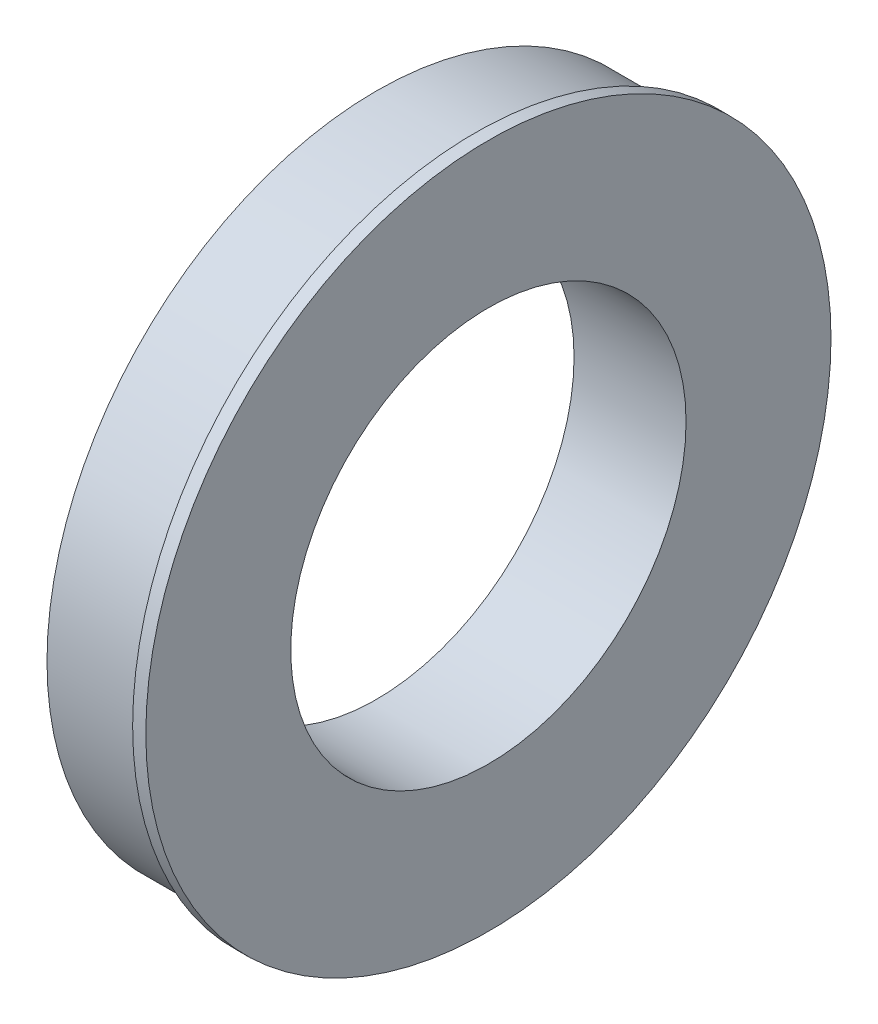
ISO-10303-21;
HEADER;
FILE_DESCRIPTION(('STEP AP214'),'2;1');
FILE_NAME('part.step','',(''),(''),'','','');
FILE_SCHEMA(('AUTOMOTIVE_DESIGN { 1 0 10303 214 1 1 1 1 }'));
ENDSEC;
DATA;
#1=APPLICATION_CONTEXT('core data for automotive mechanical design processes');
#2=APPLICATION_PROTOCOL_DEFINITION('international standard','automotive_design',2000,#1);
#3=PRODUCT_CONTEXT('',#1,'mechanical');
#4=PRODUCT('Part','Part','',(#3));
#5=PRODUCT_RELATED_PRODUCT_CATEGORY('part','',(#4));
#6=PRODUCT_DEFINITION_FORMATION('','',#4);
#7=PRODUCT_DEFINITION_CONTEXT('part definition',#1,'design');
#8=PRODUCT_DEFINITION('design','',#6,#7);
#9=PRODUCT_DEFINITION_SHAPE('','',#8);
#10=(LENGTH_UNIT() NAMED_UNIT(*) SI_UNIT(.MILLI.,.METRE.));
#11=(NAMED_UNIT(*) PLANE_ANGLE_UNIT() SI_UNIT($,.RADIAN.));
#12=(NAMED_UNIT(*) SI_UNIT($,.STERADIAN.) SOLID_ANGLE_UNIT());
#13=UNCERTAINTY_MEASURE_WITH_UNIT(LENGTH_MEASURE(1.E-05),#10,'distance_accuracy_value','');
#14=(GEOMETRIC_REPRESENTATION_CONTEXT(3) GLOBAL_UNCERTAINTY_ASSIGNED_CONTEXT((#13)) GLOBAL_UNIT_ASSIGNED_CONTEXT((#10,
#11,#12)) REPRESENTATION_CONTEXT('',''));
#15=CARTESIAN_POINT('',(0.,0.,0.));
#16=DIRECTION('',(0.,0.,1.));
#17=DIRECTION('',(1.,0.,0.));
#18=AXIS2_PLACEMENT_3D('',#15,#16,#17);
#19=CARTESIAN_POINT('',(0.,0.,0.));
#20=DIRECTION('',(1.,0.,0.));
#21=DIRECTION('',(0.,0.,-1.));
#22=AXIS2_PLACEMENT_3D('',#19,#20,#21);
#23=PLANE('',#22);
#24=CARTESIAN_POINT('',(0.,0.,0.));
#25=DIRECTION('',(1.,0.,0.));
#26=DIRECTION('',(0.,0.,-1.));
#27=AXIS2_PLACEMENT_3D('',#24,#25,#26);
#28=CIRCLE('',#27,63.5);
#29=CARTESIAN_POINT('',(0.,0.,-63.5));
#30=VERTEX_POINT('',#29);
#31=EDGE_CURVE('E41',#30,#30,#28,.T.);
#32=ORIENTED_EDGE('',*,*,#31,.F.);
#33=EDGE_LOOP('',(#32));
#34=FACE_BOUND('',#33,.T.);
#35=CARTESIAN_POINT('',(0.,0.,0.));
#36=DIRECTION('',(1.,0.,0.));
#37=DIRECTION('',(0.,0.,-1.));
#38=AXIS2_PLACEMENT_3D('',#35,#36,#37);
#39=CIRCLE('',#38,38.1);
#40=CARTESIAN_POINT('',(0.,0.,-38.1));
#41=VERTEX_POINT('',#40);
#42=EDGE_CURVE('E50',#41,#41,#39,.T.);
#43=ORIENTED_EDGE('',*,*,#42,.T.);
#44=EDGE_LOOP('',(#43));
#45=FACE_BOUND('',#44,.T.);
#46=ADVANCED_FACE('F37',(#34,#45),#23,.F.);
#47=CARTESIAN_POINT('',(19.05,0.,0.));
#48=DIRECTION('',(-1.,0.,0.));
#49=DIRECTION('',(0.,0.,1.));
#50=AXIS2_PLACEMENT_3D('',#47,#48,#49);
#51=CYLINDRICAL_SURFACE('',#50,63.5);
#52=CARTESIAN_POINT('',(19.05,0.,0.));
#53=DIRECTION('',(1.,0.,0.));
#54=DIRECTION('',(0.,0.,-1.));
#55=AXIS2_PLACEMENT_3D('',#52,#53,#54);
#56=CIRCLE('',#55,63.5);
#57=CARTESIAN_POINT('',(19.05,0.,-63.5));
#58=VERTEX_POINT('',#57);
#59=EDGE_CURVE('E10',#58,#58,#56,.T.);
#60=ORIENTED_EDGE('',*,*,#59,.F.);
#61=EDGE_LOOP('',(#60));
#62=FACE_BOUND('',#61,.T.);
#63=ORIENTED_EDGE('',*,*,#31,.T.);
#64=EDGE_LOOP('',(#63));
#65=FACE_BOUND('',#64,.T.);
#66=ADVANCED_FACE('F39',(#62,#65),#51,.T.);
#67=CARTESIAN_POINT('',(19.05,0.,0.));
#68=DIRECTION('',(-1.,0.,0.));
#69=DIRECTION('',(0.,0.,1.));
#70=AXIS2_PLACEMENT_3D('',#67,#68,#69);
#71=CYLINDRICAL_SURFACE('',#70,38.1);
#72=ORIENTED_EDGE('',*,*,#42,.F.);
#73=EDGE_LOOP('',(#72));
#74=FACE_BOUND('',#73,.T.);
#75=CARTESIAN_POINT('',(21.59,0.,0.));
#76=DIRECTION('',(1.,0.,0.));
#77=DIRECTION('',(0.,0.,-1.));
#78=AXIS2_PLACEMENT_3D('',#75,#76,#77);
#79=CIRCLE('',#78,38.1);
#80=CARTESIAN_POINT('',(21.59,0.,-38.1));
#81=VERTEX_POINT('',#80);
#82=EDGE_CURVE('E60',#81,#81,#79,.T.);
#83=ORIENTED_EDGE('',*,*,#82,.T.);
#84=EDGE_LOOP('',(#83));
#85=FACE_BOUND('',#84,.T.);
#86=ADVANCED_FACE('F68',(#74,#85),#71,.F.);
#87=CARTESIAN_POINT('',(21.59,0.,0.));
#88=DIRECTION('',(1.,0.,0.));
#89=DIRECTION('',(0.,0.,-1.));
#90=AXIS2_PLACEMENT_3D('',#87,#88,#89);
#91=PLANE('',#90);
#92=CARTESIAN_POINT('',(21.59,0.,0.));
#93=DIRECTION('',(1.,0.,0.));
#94=DIRECTION('',(0.,0.,-1.));
#95=AXIS2_PLACEMENT_3D('',#92,#93,#94);
#96=CIRCLE('',#95,66.04);
#97=CARTESIAN_POINT('',(21.59,0.,-66.04));
#98=VERTEX_POINT('',#97);
#99=EDGE_CURVE('E55',#98,#98,#96,.T.);
#100=ORIENTED_EDGE('',*,*,#99,.T.);
#101=EDGE_LOOP('',(#100));
#102=FACE_BOUND('',#101,.T.);
#103=ORIENTED_EDGE('',*,*,#82,.F.);
#104=EDGE_LOOP('',(#103));
#105=FACE_BOUND('',#104,.T.);
#106=ADVANCED_FACE('F70',(#102,#105),#91,.T.);
#107=CARTESIAN_POINT('',(19.05,0.,0.));
#108=DIRECTION('',(1.,0.,0.));
#109=DIRECTION('',(0.,0.,-1.));
#110=AXIS2_PLACEMENT_3D('',#107,#108,#109);
#111=PLANE('',#110);
#112=ORIENTED_EDGE('',*,*,#59,.T.);
#113=EDGE_LOOP('',(#112));
#114=FACE_BOUND('',#113,.T.);
#115=CARTESIAN_POINT('',(19.05,0.,0.));
#116=DIRECTION('',(1.,0.,0.));
#117=DIRECTION('',(0.,0.,-1.));
#118=AXIS2_PLACEMENT_3D('',#115,#116,#117);
#119=CIRCLE('',#118,66.04);
#120=CARTESIAN_POINT('',(19.05,0.,-66.04));
#121=VERTEX_POINT('',#120);
#122=EDGE_CURVE('E56',#121,#121,#119,.T.);
#123=ORIENTED_EDGE('',*,*,#122,.F.);
#124=EDGE_LOOP('',(#123));
#125=FACE_BOUND('',#124,.T.);
#126=ADVANCED_FACE('F72',(#114,#125),#111,.F.);
#127=CARTESIAN_POINT('',(21.59,0.,0.));
#128=DIRECTION('',(-1.,0.,0.));
#129=DIRECTION('',(0.,0.,1.));
#130=AXIS2_PLACEMENT_3D('',#127,#128,#129);
#131=CYLINDRICAL_SURFACE('',#130,66.04);
#132=ORIENTED_EDGE('',*,*,#99,.F.);
#133=EDGE_LOOP('',(#132));
#134=FACE_BOUND('',#133,.T.);
#135=ORIENTED_EDGE('',*,*,#122,.T.);
#136=EDGE_LOOP('',(#135));
#137=FACE_BOUND('',#136,.T.);
#138=ADVANCED_FACE('F79',(#134,#137),#131,.T.);
#139=CLOSED_SHELL('',(#46,#66,#86,#106,#126,#138));
#140=MANIFOLD_SOLID_BREP('B2',#139);
#141=ADVANCED_BREP_SHAPE_REPRESENTATION('',(#18,#140),#14);
#142=SHAPE_DEFINITION_REPRESENTATION(#9,#141);
ENDSEC;
END-ISO-10303-21;
